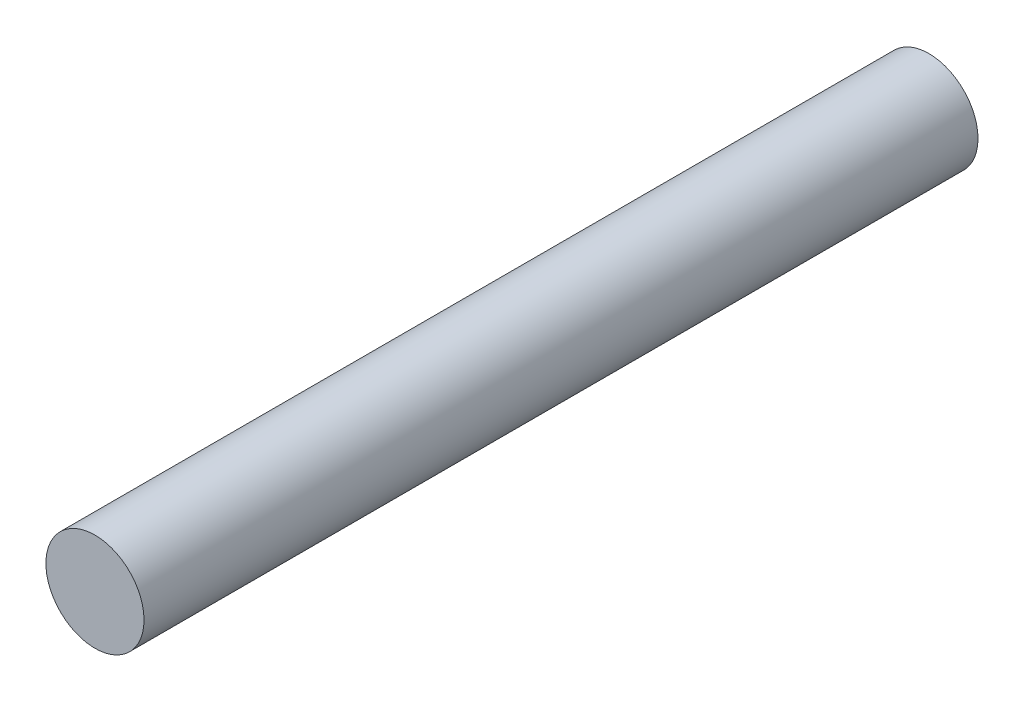
ISO-10303-21;
HEADER;
FILE_DESCRIPTION(('STEP AP214'),'2;1');
FILE_NAME('part.step','',(''),(''),'','','');
FILE_SCHEMA(('AUTOMOTIVE_DESIGN { 1 0 10303 214 1 1 1 1 }'));
ENDSEC;
DATA;
#1=APPLICATION_CONTEXT('core data for automotive mechanical design processes');
#2=APPLICATION_PROTOCOL_DEFINITION('international standard','automotive_design',2000,#1);
#3=PRODUCT_CONTEXT('',#1,'mechanical');
#4=PRODUCT('Part','Part','',(#3));
#5=PRODUCT_RELATED_PRODUCT_CATEGORY('part','',(#4));
#6=PRODUCT_DEFINITION_FORMATION('','',#4);
#7=PRODUCT_DEFINITION_CONTEXT('part definition',#1,'design');
#8=PRODUCT_DEFINITION('design','',#6,#7);
#9=PRODUCT_DEFINITION_SHAPE('','',#8);
#10=(LENGTH_UNIT() NAMED_UNIT(*) SI_UNIT(.MILLI.,.METRE.));
#11=(NAMED_UNIT(*) PLANE_ANGLE_UNIT() SI_UNIT($,.RADIAN.));
#12=(NAMED_UNIT(*) SI_UNIT($,.STERADIAN.) SOLID_ANGLE_UNIT());
#13=UNCERTAINTY_MEASURE_WITH_UNIT(LENGTH_MEASURE(1.E-05),#10,'distance_accuracy_value','');
#14=(GEOMETRIC_REPRESENTATION_CONTEXT(3) GLOBAL_UNCERTAINTY_ASSIGNED_CONTEXT((#13)) GLOBAL_UNIT_ASSIGNED_CONTEXT((#10,
#11,#12)) REPRESENTATION_CONTEXT('',''));
#15=CARTESIAN_POINT('',(0.,0.,0.));
#16=DIRECTION('',(0.,0.,1.));
#17=DIRECTION('',(1.,0.,0.));
#18=AXIS2_PLACEMENT_3D('',#15,#16,#17);
#19=CARTESIAN_POINT('',(0.,0.,85.));
#20=DIRECTION('',(0.,0.,-1.));
#21=DIRECTION('',(-1.,0.,0.));
#22=AXIS2_PLACEMENT_3D('',#19,#20,#21);
#23=CYLINDRICAL_SURFACE('',#22,5.);
#24=CARTESIAN_POINT('',(0.,0.,85.));
#25=DIRECTION('',(0.,0.,1.));
#26=DIRECTION('',(1.,0.,0.));
#27=AXIS2_PLACEMENT_3D('',#24,#25,#26);
#28=CIRCLE('',#27,5.);
#29=CARTESIAN_POINT('',(5.,0.,85.));
#30=VERTEX_POINT('',#29);
#31=EDGE_CURVE('E10',#30,#30,#28,.T.);
#32=ORIENTED_EDGE('',*,*,#31,.F.);
#33=EDGE_LOOP('',(#32));
#34=FACE_BOUND('',#33,.T.);
#35=CARTESIAN_POINT('',(0.,0.,0.));
#36=DIRECTION('',(0.,0.,1.));
#37=DIRECTION('',(1.,0.,0.));
#38=AXIS2_PLACEMENT_3D('',#35,#36,#37);
#39=CIRCLE('',#38,5.);
#40=CARTESIAN_POINT('',(5.,0.,0.));
#41=VERTEX_POINT('',#40);
#42=EDGE_CURVE('E34',#41,#41,#39,.T.);
#43=ORIENTED_EDGE('',*,*,#42,.T.);
#44=EDGE_LOOP('',(#43));
#45=FACE_BOUND('',#44,.T.);
#46=ADVANCED_FACE('F31',(#34,#45),#23,.T.);
#47=CARTESIAN_POINT('',(0.,0.,85.));
#48=DIRECTION('',(0.,0.,1.));
#49=DIRECTION('',(1.,0.,0.));
#50=AXIS2_PLACEMENT_3D('',#47,#48,#49);
#51=PLANE('',#50);
#52=ORIENTED_EDGE('',*,*,#31,.T.);
#53=EDGE_LOOP('',(#52));
#54=FACE_BOUND('',#53,.T.);
#55=ADVANCED_FACE('F46',(#54),#51,.T.);
#56=CARTESIAN_POINT('',(0.,0.,0.));
#57=DIRECTION('',(0.,0.,1.));
#58=DIRECTION('',(1.,0.,0.));
#59=AXIS2_PLACEMENT_3D('',#56,#57,#58);
#60=PLANE('',#59);
#61=ORIENTED_EDGE('',*,*,#42,.F.);
#62=EDGE_LOOP('',(#61));
#63=FACE_BOUND('',#62,.T.);
#64=ADVANCED_FACE('F44',(#63),#60,.F.);
#65=CLOSED_SHELL('',(#46,#55,#64));
#66=MANIFOLD_SOLID_BREP('B2',#65);
#67=ADVANCED_BREP_SHAPE_REPRESENTATION('',(#18,#66),#14);
#68=SHAPE_DEFINITION_REPRESENTATION(#9,#67);
ENDSEC;
END-ISO-10303-21;
